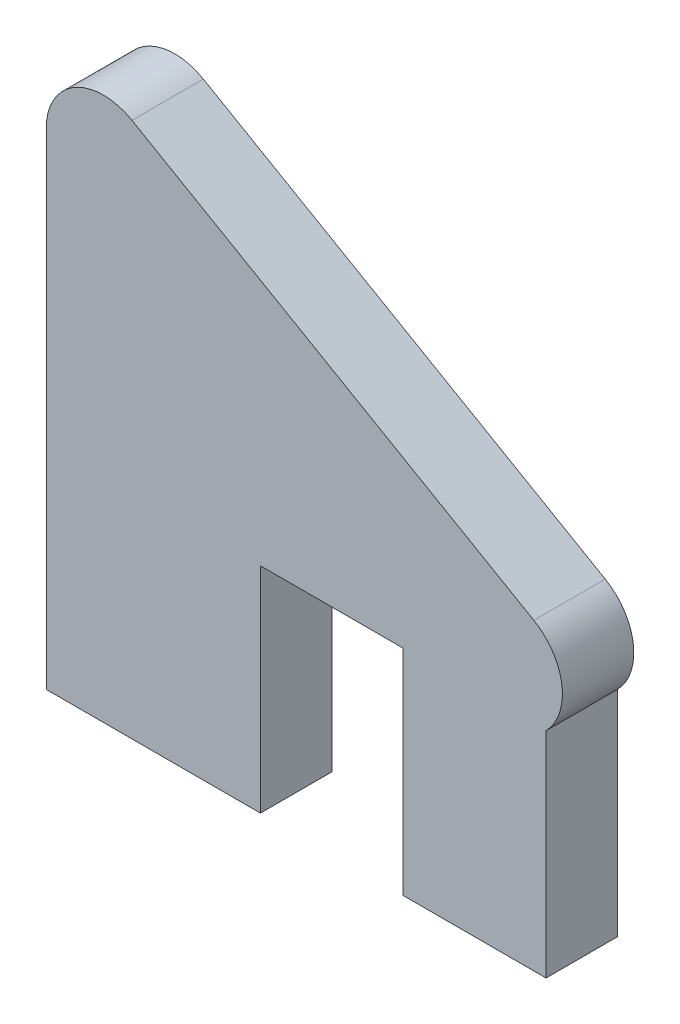
ISO-10303-21;
HEADER;
FILE_DESCRIPTION(('STEP AP214'),'2;1');
FILE_NAME('part.step','',(''),(''),'','','');
FILE_SCHEMA(('AUTOMOTIVE_DESIGN { 1 0 10303 214 1 1 1 1 }'));
ENDSEC;
DATA;
#1=APPLICATION_CONTEXT('core data for automotive mechanical design processes');
#2=APPLICATION_PROTOCOL_DEFINITION('international standard','automotive_design',2000,#1);
#3=PRODUCT_CONTEXT('',#1,'mechanical');
#4=PRODUCT('Part','Part','',(#3));
#5=PRODUCT_RELATED_PRODUCT_CATEGORY('part','',(#4));
#6=PRODUCT_DEFINITION_FORMATION('','',#4);
#7=PRODUCT_DEFINITION_CONTEXT('part definition',#1,'design');
#8=PRODUCT_DEFINITION('design','',#6,#7);
#9=PRODUCT_DEFINITION_SHAPE('','',#8);
#10=(LENGTH_UNIT() NAMED_UNIT(*) SI_UNIT(.MILLI.,.METRE.));
#11=(NAMED_UNIT(*) PLANE_ANGLE_UNIT() SI_UNIT($,.RADIAN.));
#12=(NAMED_UNIT(*) SI_UNIT($,.STERADIAN.) SOLID_ANGLE_UNIT());
#13=UNCERTAINTY_MEASURE_WITH_UNIT(LENGTH_MEASURE(1.E-05),#10,'distance_accuracy_value','');
#14=(GEOMETRIC_REPRESENTATION_CONTEXT(3) GLOBAL_UNCERTAINTY_ASSIGNED_CONTEXT((#13)) GLOBAL_UNIT_ASSIGNED_CONTEXT((#10,
#11,#12)) REPRESENTATION_CONTEXT('',''));
#15=CARTESIAN_POINT('',(0.,0.,0.));
#16=DIRECTION('',(0.,0.,1.));
#17=DIRECTION('',(1.,0.,0.));
#18=AXIS2_PLACEMENT_3D('',#15,#16,#17);
#19=CARTESIAN_POINT('',(9.525,0.,3.175));
#20=DIRECTION('',(1.,0.,0.));
#21=DIRECTION('',(0.,0.,-1.));
#22=AXIS2_PLACEMENT_3D('',#19,#20,#21);
#23=PLANE('',#22);
#24=DIRECTION('',(0.,-1.,0.));
#25=VECTOR('',#24,1.);
#26=CARTESIAN_POINT('',(9.525,0.,0.));
#27=LINE('',#26,#25);
#28=CARTESIAN_POINT('',(9.525,0.,0.));
#29=VERTEX_POINT('',#28);
#30=CARTESIAN_POINT('',(9.525,-9.525,0.));
#31=VERTEX_POINT('',#30);
#32=EDGE_CURVE('E116',#29,#31,#27,.T.);
#33=ORIENTED_EDGE('',*,*,#32,.F.);
#34=DIRECTION('',(0.,0.,-1.));
#35=VECTOR('',#34,1.);
#36=CARTESIAN_POINT('',(9.525,0.,3.175));
#37=LINE('',#36,#35);
#38=CARTESIAN_POINT('',(9.525,0.,3.175));
#39=VERTEX_POINT('',#38);
#40=EDGE_CURVE('E111',#39,#29,#37,.T.);
#41=ORIENTED_EDGE('',*,*,#40,.F.);
#42=DIRECTION('',(0.,-1.,0.));
#43=VECTOR('',#42,1.);
#44=CARTESIAN_POINT('',(9.525,0.,3.175));
#45=LINE('',#44,#43);
#46=CARTESIAN_POINT('',(9.525,-9.525,3.175));
#47=VERTEX_POINT('',#46);
#48=EDGE_CURVE('E114',#39,#47,#45,.T.);
#49=ORIENTED_EDGE('',*,*,#48,.T.);
#50=DIRECTION('',(0.,0.,-1.));
#51=VECTOR('',#50,1.);
#52=CARTESIAN_POINT('',(9.525,-9.525,3.175));
#53=LINE('',#52,#51);
#54=EDGE_CURVE('E151',#47,#31,#53,.T.);
#55=ORIENTED_EDGE('',*,*,#54,.T.);
#56=EDGE_LOOP('',(#33,#41,#49,#55));
#57=FACE_BOUND('',#56,.T.);
#58=ADVANCED_FACE('F33',(#57),#23,.T.);
#59=CARTESIAN_POINT('',(0.,0.,3.175));
#60=DIRECTION('',(0.,1.,0.));
#61=DIRECTION('',(0.,0.,1.));
#62=AXIS2_PLACEMENT_3D('',#59,#60,#61);
#63=PLANE('',#62);
#64=DIRECTION('',(1.,0.,0.));
#65=VECTOR('',#64,1.);
#66=CARTESIAN_POINT('',(0.,0.,0.));
#67=LINE('',#66,#65);
#68=CARTESIAN_POINT('',(15.875,0.,0.));
#69=VERTEX_POINT('',#68);
#70=EDGE_CURVE('E153',#29,#69,#67,.T.);
#71=ORIENTED_EDGE('',*,*,#70,.T.);
#72=DIRECTION('',(0.,0.,-1.));
#73=VECTOR('',#72,1.);
#74=CARTESIAN_POINT('',(15.875,0.,3.175));
#75=LINE('',#74,#73);
#76=CARTESIAN_POINT('',(15.875,0.,3.175));
#77=VERTEX_POINT('',#76);
#78=EDGE_CURVE('E120',#77,#69,#75,.T.);
#79=ORIENTED_EDGE('',*,*,#78,.F.);
#80=DIRECTION('',(1.,0.,0.));
#81=VECTOR('',#80,1.);
#82=CARTESIAN_POINT('',(0.,0.,3.175));
#83=LINE('',#82,#81);
#84=EDGE_CURVE('E123',#39,#77,#83,.T.);
#85=ORIENTED_EDGE('',*,*,#84,.F.);
#86=ORIENTED_EDGE('',*,*,#40,.T.);
#87=EDGE_LOOP('',(#71,#79,#85,#86));
#88=FACE_BOUND('',#87,.T.);
#89=ADVANCED_FACE('F124',(#88),#63,.F.);
#90=CARTESIAN_POINT('',(15.875,0.,3.175));
#91=DIRECTION('',(1.,0.,0.));
#92=DIRECTION('',(0.,0.,-1.));
#93=AXIS2_PLACEMENT_3D('',#90,#91,#92);
#94=PLANE('',#93);
#95=DIRECTION('',(0.,-1.,0.));
#96=VECTOR('',#95,1.);
#97=CARTESIAN_POINT('',(15.875,0.,0.));
#98=LINE('',#97,#96);
#99=CARTESIAN_POINT('',(15.875,-9.525,0.));
#100=VERTEX_POINT('',#99);
#101=EDGE_CURVE('E155',#69,#100,#98,.T.);
#102=ORIENTED_EDGE('',*,*,#101,.T.);
#103=DIRECTION('',(0.,0.,-1.));
#104=VECTOR('',#103,1.);
#105=CARTESIAN_POINT('',(15.875,-9.525,3.175));
#106=LINE('',#105,#104);
#107=CARTESIAN_POINT('',(15.875,-9.525,3.175));
#108=VERTEX_POINT('',#107);
#109=EDGE_CURVE('E176',#108,#100,#106,.T.);
#110=ORIENTED_EDGE('',*,*,#109,.F.);
#111=DIRECTION('',(0.,-1.,0.));
#112=VECTOR('',#111,1.);
#113=CARTESIAN_POINT('',(15.875,0.,3.175));
#114=LINE('',#113,#112);
#115=EDGE_CURVE('E127',#77,#108,#114,.T.);
#116=ORIENTED_EDGE('',*,*,#115,.F.);
#117=ORIENTED_EDGE('',*,*,#78,.T.);
#118=EDGE_LOOP('',(#102,#110,#116,#117));
#119=FACE_BOUND('',#118,.T.);
#120=ADVANCED_FACE('F208',(#119),#94,.F.);
#121=CARTESIAN_POINT('',(0.,-9.525,3.175));
#122=DIRECTION('',(0.,1.,0.));
#123=DIRECTION('',(0.,0.,1.));
#124=AXIS2_PLACEMENT_3D('',#121,#122,#123);
#125=PLANE('',#124);
#126=DIRECTION('',(1.,0.,0.));
#127=VECTOR('',#126,1.);
#128=CARTESIAN_POINT('',(0.,-9.525,0.));
#129=LINE('',#128,#127);
#130=CARTESIAN_POINT('',(22.225,-9.525,0.));
#131=VERTEX_POINT('',#130);
#132=EDGE_CURVE('E157',#100,#131,#129,.T.);
#133=ORIENTED_EDGE('',*,*,#132,.T.);
#134=DIRECTION('',(0.,0.,-1.));
#135=VECTOR('',#134,1.);
#136=CARTESIAN_POINT('',(22.225,-9.525,3.175));
#137=LINE('',#136,#135);
#138=CARTESIAN_POINT('',(22.225,-9.525,3.175));
#139=VERTEX_POINT('',#138);
#140=EDGE_CURVE('E174',#139,#131,#137,.T.);
#141=ORIENTED_EDGE('',*,*,#140,.F.);
#142=DIRECTION('',(1.,0.,0.));
#143=VECTOR('',#142,1.);
#144=CARTESIAN_POINT('',(0.,-9.525,3.175));
#145=LINE('',#144,#143);
#146=EDGE_CURVE('E141',#108,#139,#145,.T.);
#147=ORIENTED_EDGE('',*,*,#146,.F.);
#148=ORIENTED_EDGE('',*,*,#109,.T.);
#149=EDGE_LOOP('',(#133,#141,#147,#148));
#150=FACE_BOUND('',#149,.T.);
#151=ADVANCED_FACE('F204',(#150),#125,.F.);
#152=CARTESIAN_POINT('',(22.225,0.,3.175));
#153=DIRECTION('',(1.,0.,0.));
#154=DIRECTION('',(0.,0.,-1.));
#155=AXIS2_PLACEMENT_3D('',#152,#153,#154);
#156=PLANE('',#155);
#157=DIRECTION('',(0.,-1.,0.));
#158=VECTOR('',#157,1.);
#159=CARTESIAN_POINT('',(22.225,0.,0.));
#160=LINE('',#159,#158);
#161=CARTESIAN_POINT('',(22.225,0.,0.));
#162=VERTEX_POINT('',#161);
#163=EDGE_CURVE('E160',#162,#131,#160,.T.);
#164=ORIENTED_EDGE('',*,*,#163,.F.);
#165=DIRECTION('',(0.,0.,-1.));
#166=VECTOR('',#165,1.);
#167=CARTESIAN_POINT('',(22.225,0.,3.175));
#168=LINE('',#167,#166);
#169=CARTESIAN_POINT('',(22.225,0.,3.175));
#170=VERTEX_POINT('',#169);
#171=EDGE_CURVE('E171',#170,#162,#168,.T.);
#172=ORIENTED_EDGE('',*,*,#171,.F.);
#173=DIRECTION('',(0.,-1.,0.));
#174=VECTOR('',#173,1.);
#175=CARTESIAN_POINT('',(22.225,0.,3.175));
#176=LINE('',#175,#174);
#177=EDGE_CURVE('E143',#170,#139,#176,.T.);
#178=ORIENTED_EDGE('',*,*,#177,.T.);
#179=ORIENTED_EDGE('',*,*,#140,.T.);
#180=EDGE_LOOP('',(#164,#172,#178,#179));
#181=FACE_BOUND('',#180,.T.);
#182=ADVANCED_FACE('F200',(#181),#156,.T.);
#183=CARTESIAN_POINT('',(7.14374999999985,12.3733379565701,3.175));
#184=DIRECTION('',(-0.499999999999995,-0.866025403784442,0.));
#185=DIRECTION('',(0.866025403784442,-0.499999999999995,0.));
#186=AXIS2_PLACEMENT_3D('',#183,#184,#185);
#187=PLANE('',#186);
#188=DIRECTION('',(-0.866025403784442,0.499999999999995,0.));
#189=VECTOR('',#188,1.);
#190=CARTESIAN_POINT('',(7.14374999999985,12.3733379565701,3.175));
#191=LINE('',#190,#189);
#192=CARTESIAN_POINT('',(21.6826452514314,3.97930286943642,3.175));
#193=VERTEX_POINT('',#192);
#194=CARTESIAN_POINT('',(3.80999999999999,14.2980794164809,3.175));
#195=VERTEX_POINT('',#194);
#196=EDGE_CURVE('E146',#193,#195,#191,.T.);
#197=ORIENTED_EDGE('',*,*,#196,.F.);
#198=DIRECTION('',(0.,0.,-1.));
#199=VECTOR('',#198,1.);
#200=CARTESIAN_POINT('',(21.6826452514314,3.97930286943642,3.175));
#201=LINE('',#200,#199);
#202=CARTESIAN_POINT('',(21.6826452514314,3.97930286943642,0.));
#203=VERTEX_POINT('',#202);
#204=EDGE_CURVE('E181',#193,#203,#201,.T.);
#205=ORIENTED_EDGE('',*,*,#204,.T.);
#206=DIRECTION('',(-0.866025403784442,0.499999999999995,0.));
#207=VECTOR('',#206,1.);
#208=CARTESIAN_POINT('',(7.14374999999985,12.3733379565701,0.));
#209=LINE('',#208,#207);
#210=CARTESIAN_POINT('',(3.80999999999999,14.2980794164809,0.));
#211=VERTEX_POINT('',#210);
#212=EDGE_CURVE('E163',#203,#211,#209,.T.);
#213=ORIENTED_EDGE('',*,*,#212,.T.);
#214=DIRECTION('',(0.,0.,-1.));
#215=VECTOR('',#214,1.);
#216=CARTESIAN_POINT('',(3.80999999999999,14.2980794164809,3.175));
#217=LINE('',#216,#215);
#218=EDGE_CURVE('E119',#211,#195,#217,.F.);
#219=ORIENTED_EDGE('',*,*,#218,.T.);
#220=EDGE_LOOP('',(#197,#205,#213,#219));
#221=FACE_BOUND('',#220,.T.);
#222=ADVANCED_FACE('F192',(#221),#187,.F.);
#223=CARTESIAN_POINT('',(0.,0.,3.175));
#224=DIRECTION('',(1.,0.,0.));
#225=DIRECTION('',(0.,0.,-1.));
#226=AXIS2_PLACEMENT_3D('',#223,#224,#225);
#227=PLANE('',#226);
#228=DIRECTION('',(0.,-1.,0.));
#229=VECTOR('',#228,1.);
#230=CARTESIAN_POINT('',(0.,0.,3.175));
#231=LINE('',#230,#229);
#232=CARTESIAN_POINT('',(0.,12.0983748908684,3.175));
#233=VERTEX_POINT('',#232);
#234=CARTESIAN_POINT('',(0.,-9.525,3.175));
#235=VERTEX_POINT('',#234);
#236=EDGE_CURVE('E148',#233,#235,#231,.T.);
#237=ORIENTED_EDGE('',*,*,#236,.F.);
#238=DIRECTION('',(0.,0.,-1.));
#239=VECTOR('',#238,1.);
#240=CARTESIAN_POINT('',(0.,12.0983748908684,3.175));
#241=LINE('',#240,#239);
#242=CARTESIAN_POINT('',(0.,12.0983748908684,0.));
#243=VERTEX_POINT('',#242);
#244=EDGE_CURVE('E11',#233,#243,#241,.T.);
#245=ORIENTED_EDGE('',*,*,#244,.T.);
#246=DIRECTION('',(0.,-1.,0.));
#247=VECTOR('',#246,1.);
#248=CARTESIAN_POINT('',(0.,0.,0.));
#249=LINE('',#248,#247);
#250=CARTESIAN_POINT('',(0.,-9.525,0.));
#251=VERTEX_POINT('',#250);
#252=EDGE_CURVE('E137',#243,#251,#249,.T.);
#253=ORIENTED_EDGE('',*,*,#252,.T.);
#254=DIRECTION('',(0.,0.,-1.));
#255=VECTOR('',#254,1.);
#256=CARTESIAN_POINT('',(0.,-9.525,3.175));
#257=LINE('',#256,#255);
#258=EDGE_CURVE('E168',#235,#251,#257,.T.);
#259=ORIENTED_EDGE('',*,*,#258,.F.);
#260=EDGE_LOOP('',(#237,#245,#253,#259));
#261=FACE_BOUND('',#260,.T.);
#262=ADVANCED_FACE('F235',(#261),#227,.F.);
#263=CARTESIAN_POINT('',(0.,-9.525,3.175));
#264=DIRECTION('',(0.,1.,0.));
#265=DIRECTION('',(0.,0.,1.));
#266=AXIS2_PLACEMENT_3D('',#263,#264,#265);
#267=PLANE('',#266);
#268=DIRECTION('',(1.,0.,0.));
#269=VECTOR('',#268,1.);
#270=CARTESIAN_POINT('',(0.,-9.525,0.));
#271=LINE('',#270,#269);
#272=EDGE_CURVE('E134',#251,#31,#271,.T.);
#273=ORIENTED_EDGE('',*,*,#272,.T.);
#274=ORIENTED_EDGE('',*,*,#54,.F.);
#275=DIRECTION('',(1.,0.,0.));
#276=VECTOR('',#275,1.);
#277=CARTESIAN_POINT('',(0.,-9.525,3.175));
#278=LINE('',#277,#276);
#279=EDGE_CURVE('E132',#235,#47,#278,.T.);
#280=ORIENTED_EDGE('',*,*,#279,.F.);
#281=ORIENTED_EDGE('',*,*,#258,.T.);
#282=EDGE_LOOP('',(#273,#274,#280,#281));
#283=FACE_BOUND('',#282,.T.);
#284=ADVANCED_FACE('F230',(#283),#267,.F.);
#285=CARTESIAN_POINT('',(0.,0.,3.175));
#286=DIRECTION('',(0.,0.,1.));
#287=DIRECTION('',(1.,0.,0.));
#288=AXIS2_PLACEMENT_3D('',#285,#286,#287);
#289=PLANE('',#288);
#290=ORIENTED_EDGE('',*,*,#177,.F.);
#291=CARTESIAN_POINT('',(20.4126452514314,1.77959834382394,3.175));
#292=DIRECTION('',(0.,0.,1.));
#293=DIRECTION('',(1.,0.,0.));
#294=AXIS2_PLACEMENT_3D('',#291,#292,#293);
#295=CIRCLE('',#294,2.54);
#296=EDGE_CURVE('E41',#170,#193,#295,.T.);
#297=ORIENTED_EDGE('',*,*,#296,.T.);
#298=ORIENTED_EDGE('',*,*,#196,.T.);
#299=CARTESIAN_POINT('',(2.54,12.0983748908684,3.175));
#300=DIRECTION('',(0.,0.,1.));
#301=DIRECTION('',(1.,0.,0.));
#302=AXIS2_PLACEMENT_3D('',#299,#300,#301);
#303=CIRCLE('',#302,2.54);
#304=EDGE_CURVE('E48',#195,#233,#303,.T.);
#305=ORIENTED_EDGE('',*,*,#304,.T.);
#306=ORIENTED_EDGE('',*,*,#236,.T.);
#307=ORIENTED_EDGE('',*,*,#279,.T.);
#308=ORIENTED_EDGE('',*,*,#48,.F.);
#309=ORIENTED_EDGE('',*,*,#84,.T.);
#310=ORIENTED_EDGE('',*,*,#115,.T.);
#311=ORIENTED_EDGE('',*,*,#146,.T.);
#312=EDGE_LOOP('',(#290,#297,#298,#305,#306,#307,#308,#309,#310,#311));
#313=FACE_BOUND('',#312,.T.);
#314=ADVANCED_FACE('F130',(#313),#289,.T.);
#315=CARTESIAN_POINT('',(0.,0.,0.));
#316=DIRECTION('',(0.,0.,1.));
#317=DIRECTION('',(1.,0.,0.));
#318=AXIS2_PLACEMENT_3D('',#315,#316,#317);
#319=PLANE('',#318);
#320=ORIENTED_EDGE('',*,*,#212,.F.);
#321=CARTESIAN_POINT('',(20.4126452514314,1.77959834382394,0.));
#322=DIRECTION('',(0.,0.,1.));
#323=DIRECTION('',(1.,0.,0.));
#324=AXIS2_PLACEMENT_3D('',#321,#322,#323);
#325=CIRCLE('',#324,2.54);
#326=EDGE_CURVE('E185',#203,#162,#325,.F.);
#327=ORIENTED_EDGE('',*,*,#326,.T.);
#328=ORIENTED_EDGE('',*,*,#163,.T.);
#329=ORIENTED_EDGE('',*,*,#132,.F.);
#330=ORIENTED_EDGE('',*,*,#101,.F.);
#331=ORIENTED_EDGE('',*,*,#70,.F.);
#332=ORIENTED_EDGE('',*,*,#32,.T.);
#333=ORIENTED_EDGE('',*,*,#272,.F.);
#334=ORIENTED_EDGE('',*,*,#252,.F.);
#335=CARTESIAN_POINT('',(2.54,12.0983748908684,0.));
#336=DIRECTION('',(0.,0.,1.));
#337=DIRECTION('',(1.,0.,0.));
#338=AXIS2_PLACEMENT_3D('',#335,#336,#337);
#339=CIRCLE('',#338,2.54);
#340=EDGE_CURVE('E56',#243,#211,#339,.F.);
#341=ORIENTED_EDGE('',*,*,#340,.T.);
#342=EDGE_LOOP('',(#320,#327,#328,#329,#330,#331,#332,#333,#334,#341));
#343=FACE_BOUND('',#342,.T.);
#344=ADVANCED_FACE('F197',(#343),#319,.F.);
#345=CARTESIAN_POINT('',(20.4126452514314,1.77959834382394,3.175));
#346=DIRECTION('',(0.,0.,-1.));
#347=DIRECTION('',(-1.,0.,0.));
#348=AXIS2_PLACEMENT_3D('',#345,#346,#347);
#349=CYLINDRICAL_SURFACE('',#348,2.54);
#350=ORIENTED_EDGE('',*,*,#296,.F.);
#351=ORIENTED_EDGE('',*,*,#171,.T.);
#352=ORIENTED_EDGE('',*,*,#326,.F.);
#353=ORIENTED_EDGE('',*,*,#204,.F.);
#354=EDGE_LOOP('',(#350,#351,#352,#353));
#355=FACE_BOUND('',#354,.T.);
#356=ADVANCED_FACE('F194',(#355),#349,.T.);
#357=CARTESIAN_POINT('',(2.54,12.0983748908684,3.175));
#358=DIRECTION('',(0.,0.,-1.));
#359=DIRECTION('',(-1.,0.,0.));
#360=AXIS2_PLACEMENT_3D('',#357,#358,#359);
#361=CYLINDRICAL_SURFACE('',#360,2.54);
#362=ORIENTED_EDGE('',*,*,#304,.F.);
#363=ORIENTED_EDGE('',*,*,#218,.F.);
#364=ORIENTED_EDGE('',*,*,#340,.F.);
#365=ORIENTED_EDGE('',*,*,#244,.F.);
#366=EDGE_LOOP('',(#362,#363,#364,#365));
#367=FACE_BOUND('',#366,.T.);
#368=ADVANCED_FACE('F35',(#367),#361,.T.);
#369=CLOSED_SHELL('',(#58,#89,#120,#151,#182,#222,#262,#284,#314,#344,#356,#368));
#370=MANIFOLD_SOLID_BREP('B2',#369);
#371=ADVANCED_BREP_SHAPE_REPRESENTATION('',(#18,#370),#14);
#372=SHAPE_DEFINITION_REPRESENTATION(#9,#371);
ENDSEC;
END-ISO-10303-21;
